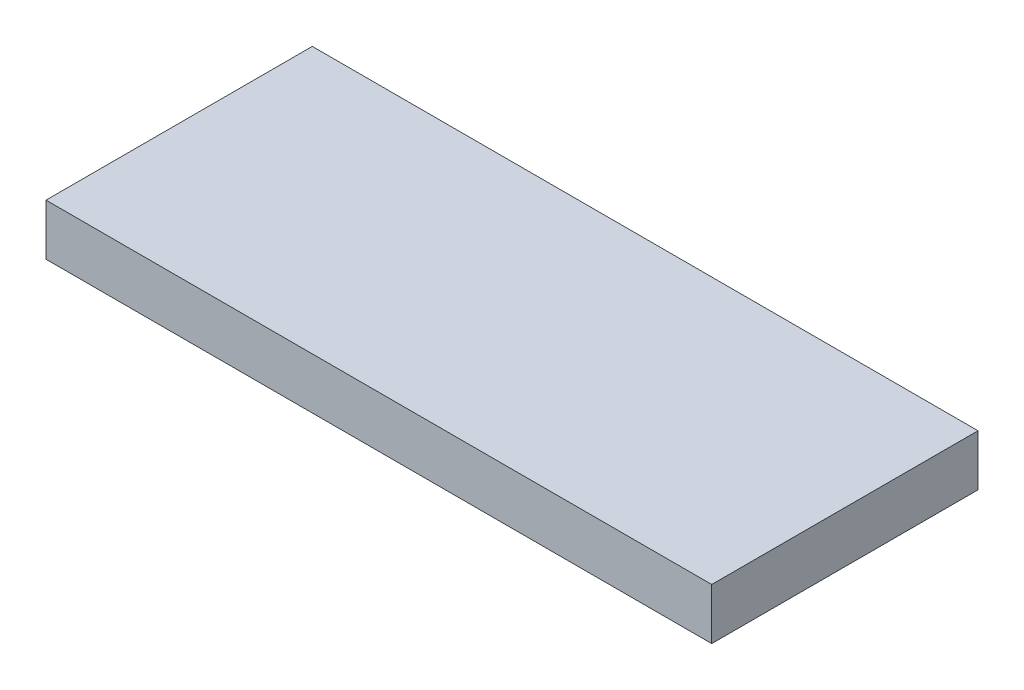
ISO-10303-21;
HEADER;
FILE_DESCRIPTION(('STEP AP214'),'2;1');
FILE_NAME('part.step','',(''),(''),'','','');
FILE_SCHEMA(('AUTOMOTIVE_DESIGN { 1 0 10303 214 1 1 1 1 }'));
ENDSEC;
DATA;
#1=APPLICATION_CONTEXT('core data for automotive mechanical design processes');
#2=APPLICATION_PROTOCOL_DEFINITION('international standard','automotive_design',2000,#1);
#3=PRODUCT_CONTEXT('',#1,'mechanical');
#4=PRODUCT('Part','Part','',(#3));
#5=PRODUCT_RELATED_PRODUCT_CATEGORY('part','',(#4));
#6=PRODUCT_DEFINITION_FORMATION('','',#4);
#7=PRODUCT_DEFINITION_CONTEXT('part definition',#1,'design');
#8=PRODUCT_DEFINITION('design','',#6,#7);
#9=PRODUCT_DEFINITION_SHAPE('','',#8);
#10=(LENGTH_UNIT() NAMED_UNIT(*) SI_UNIT(.MILLI.,.METRE.));
#11=(NAMED_UNIT(*) PLANE_ANGLE_UNIT() SI_UNIT($,.RADIAN.));
#12=(NAMED_UNIT(*) SI_UNIT($,.STERADIAN.) SOLID_ANGLE_UNIT());
#13=UNCERTAINTY_MEASURE_WITH_UNIT(LENGTH_MEASURE(1.E-05),#10,'distance_accuracy_value','');
#14=(GEOMETRIC_REPRESENTATION_CONTEXT(3) GLOBAL_UNCERTAINTY_ASSIGNED_CONTEXT((#13)) GLOBAL_UNIT_ASSIGNED_CONTEXT((#10,
#11,#12)) REPRESENTATION_CONTEXT('',''));
#15=CARTESIAN_POINT('',(0.,0.,0.));
#16=DIRECTION('',(0.,0.,1.));
#17=DIRECTION('',(1.,0.,0.));
#18=AXIS2_PLACEMENT_3D('',#15,#16,#17);
#19=CARTESIAN_POINT('',(41.275,6.35,16.51));
#20=DIRECTION('',(-1.,0.,0.));
#21=DIRECTION('',(0.,0.,1.));
#22=AXIS2_PLACEMENT_3D('',#19,#20,#21);
#23=PLANE('',#22);
#24=DIRECTION('',(0.,0.,-1.));
#25=VECTOR('',#24,1.);
#26=CARTESIAN_POINT('',(41.275,0.,16.51));
#27=LINE('',#26,#25);
#28=CARTESIAN_POINT('',(41.275,0.,16.51));
#29=VERTEX_POINT('',#28);
#30=CARTESIAN_POINT('',(41.275,0.,-16.51));
#31=VERTEX_POINT('',#30);
#32=EDGE_CURVE('E99',#29,#31,#27,.T.);
#33=ORIENTED_EDGE('',*,*,#32,.T.);
#34=DIRECTION('',(0.,-1.,0.));
#35=VECTOR('',#34,1.);
#36=CARTESIAN_POINT('',(41.275,6.35,-16.51));
#37=LINE('',#36,#35);
#38=CARTESIAN_POINT('',(41.275,6.35,-16.51));
#39=VERTEX_POINT('',#38);
#40=EDGE_CURVE('E11',#39,#31,#37,.T.);
#41=ORIENTED_EDGE('',*,*,#40,.F.);
#42=DIRECTION('',(0.,0.,-1.));
#43=VECTOR('',#42,1.);
#44=CARTESIAN_POINT('',(41.275,6.35,16.51));
#45=LINE('',#44,#43);
#46=CARTESIAN_POINT('',(41.275,6.35,16.51));
#47=VERTEX_POINT('',#46);
#48=EDGE_CURVE('E87',#47,#39,#45,.T.);
#49=ORIENTED_EDGE('',*,*,#48,.F.);
#50=DIRECTION('',(0.,-1.,0.));
#51=VECTOR('',#50,1.);
#52=CARTESIAN_POINT('',(41.275,6.35,16.51));
#53=LINE('',#52,#51);
#54=EDGE_CURVE('E95',#47,#29,#53,.T.);
#55=ORIENTED_EDGE('',*,*,#54,.T.);
#56=EDGE_LOOP('',(#33,#41,#49,#55));
#57=FACE_BOUND('',#56,.T.);
#58=ADVANCED_FACE('F36',(#57),#23,.F.);
#59=CARTESIAN_POINT('',(-41.275,6.35,-16.51));
#60=DIRECTION('',(0.,0.,1.));
#61=DIRECTION('',(1.,0.,0.));
#62=AXIS2_PLACEMENT_3D('',#59,#60,#61);
#63=PLANE('',#62);
#64=DIRECTION('',(-1.,0.,0.));
#65=VECTOR('',#64,1.);
#66=CARTESIAN_POINT('',(-41.275,0.,-16.51));
#67=LINE('',#66,#65);
#68=CARTESIAN_POINT('',(-41.275,0.,-16.51));
#69=VERTEX_POINT('',#68);
#70=EDGE_CURVE('E91',#31,#69,#67,.T.);
#71=ORIENTED_EDGE('',*,*,#70,.T.);
#72=DIRECTION('',(0.,-1.,0.));
#73=VECTOR('',#72,1.);
#74=CARTESIAN_POINT('',(-41.275,6.35,-16.51));
#75=LINE('',#74,#73);
#76=CARTESIAN_POINT('',(-41.275,6.35,-16.51));
#77=VERTEX_POINT('',#76);
#78=EDGE_CURVE('E44',#77,#69,#75,.T.);
#79=ORIENTED_EDGE('',*,*,#78,.F.);
#80=DIRECTION('',(-1.,0.,0.));
#81=VECTOR('',#80,1.);
#82=CARTESIAN_POINT('',(-41.275,6.35,-16.51));
#83=LINE('',#82,#81);
#84=EDGE_CURVE('E82',#39,#77,#83,.T.);
#85=ORIENTED_EDGE('',*,*,#84,.F.);
#86=ORIENTED_EDGE('',*,*,#40,.T.);
#87=EDGE_LOOP('',(#71,#79,#85,#86));
#88=FACE_BOUND('',#87,.T.);
#89=ADVANCED_FACE('F90',(#88),#63,.F.);
#90=CARTESIAN_POINT('',(-41.275,6.35,16.51));
#91=DIRECTION('',(1.,0.,0.));
#92=DIRECTION('',(0.,0.,-1.));
#93=AXIS2_PLACEMENT_3D('',#90,#91,#92);
#94=PLANE('',#93);
#95=DIRECTION('',(0.,0.,1.));
#96=VECTOR('',#95,1.);
#97=CARTESIAN_POINT('',(-41.275,0.,16.51));
#98=LINE('',#97,#96);
#99=CARTESIAN_POINT('',(-41.275,0.,16.51));
#100=VERTEX_POINT('',#99);
#101=EDGE_CURVE('E69',#69,#100,#98,.T.);
#102=ORIENTED_EDGE('',*,*,#101,.T.);
#103=DIRECTION('',(0.,-1.,0.));
#104=VECTOR('',#103,1.);
#105=CARTESIAN_POINT('',(-41.275,6.35,16.51));
#106=LINE('',#105,#104);
#107=CARTESIAN_POINT('',(-41.275,6.35,16.51));
#108=VERTEX_POINT('',#107);
#109=EDGE_CURVE('E92',#108,#100,#106,.T.);
#110=ORIENTED_EDGE('',*,*,#109,.F.);
#111=DIRECTION('',(0.,0.,1.));
#112=VECTOR('',#111,1.);
#113=CARTESIAN_POINT('',(-41.275,6.35,16.51));
#114=LINE('',#113,#112);
#115=EDGE_CURVE('E85',#77,#108,#114,.T.);
#116=ORIENTED_EDGE('',*,*,#115,.F.);
#117=ORIENTED_EDGE('',*,*,#78,.T.);
#118=EDGE_LOOP('',(#102,#110,#116,#117));
#119=FACE_BOUND('',#118,.T.);
#120=ADVANCED_FACE('F93',(#119),#94,.F.);
#121=CARTESIAN_POINT('',(-41.275,6.35,16.51));
#122=DIRECTION('',(0.,0.,-1.));
#123=DIRECTION('',(-1.,0.,0.));
#124=AXIS2_PLACEMENT_3D('',#121,#122,#123);
#125=PLANE('',#124);
#126=DIRECTION('',(1.,0.,0.));
#127=VECTOR('',#126,1.);
#128=CARTESIAN_POINT('',(-41.275,0.,16.51));
#129=LINE('',#128,#127);
#130=EDGE_CURVE('E75',#100,#29,#129,.T.);
#131=ORIENTED_EDGE('',*,*,#130,.T.);
#132=ORIENTED_EDGE('',*,*,#54,.F.);
#133=DIRECTION('',(1.,0.,0.));
#134=VECTOR('',#133,1.);
#135=CARTESIAN_POINT('',(-41.275,6.35,16.51));
#136=LINE('',#135,#134);
#137=EDGE_CURVE('E52',#108,#47,#136,.T.);
#138=ORIENTED_EDGE('',*,*,#137,.F.);
#139=ORIENTED_EDGE('',*,*,#109,.T.);
#140=EDGE_LOOP('',(#131,#132,#138,#139));
#141=FACE_BOUND('',#140,.T.);
#142=ADVANCED_FACE('F106',(#141),#125,.F.);
#143=CARTESIAN_POINT('',(0.,6.35,0.));
#144=DIRECTION('',(0.,-1.,0.));
#145=DIRECTION('',(0.,0.,-1.));
#146=AXIS2_PLACEMENT_3D('',#143,#144,#145);
#147=PLANE('',#146);
#148=ORIENTED_EDGE('',*,*,#48,.T.);
#149=ORIENTED_EDGE('',*,*,#84,.T.);
#150=ORIENTED_EDGE('',*,*,#115,.T.);
#151=ORIENTED_EDGE('',*,*,#137,.T.);
#152=EDGE_LOOP('',(#148,#149,#150,#151));
#153=FACE_BOUND('',#152,.T.);
#154=ADVANCED_FACE('F83',(#153),#147,.F.);
#155=CARTESIAN_POINT('',(0.,0.,0.));
#156=DIRECTION('',(0.,-1.,0.));
#157=DIRECTION('',(0.,0.,-1.));
#158=AXIS2_PLACEMENT_3D('',#155,#156,#157);
#159=PLANE('',#158);
#160=ORIENTED_EDGE('',*,*,#32,.F.);
#161=ORIENTED_EDGE('',*,*,#130,.F.);
#162=ORIENTED_EDGE('',*,*,#101,.F.);
#163=ORIENTED_EDGE('',*,*,#70,.F.);
#164=EDGE_LOOP('',(#160,#161,#162,#163));
#165=FACE_BOUND('',#164,.T.);
#166=ADVANCED_FACE('F109',(#165),#159,.T.);
#167=CLOSED_SHELL('',(#58,#89,#120,#142,#154,#166));
#168=MANIFOLD_SOLID_BREP('B2',#167);
#169=ADVANCED_BREP_SHAPE_REPRESENTATION('',(#18,#168),#14);
#170=SHAPE_DEFINITION_REPRESENTATION(#9,#169);
ENDSEC;
END-ISO-10303-21;
